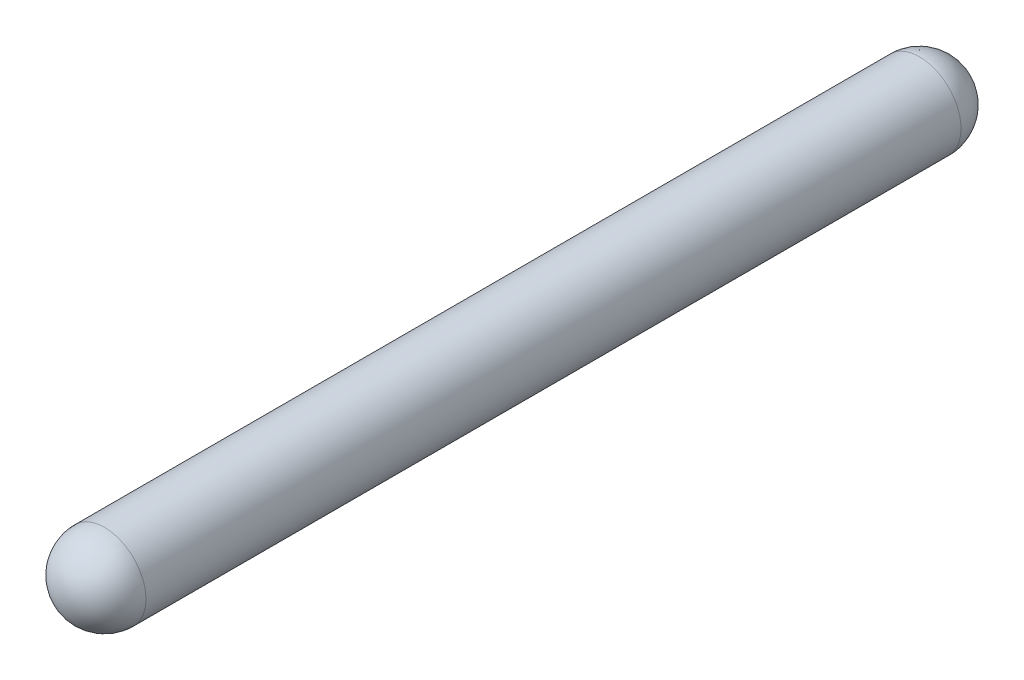
ISO-10303-21;
HEADER;
FILE_DESCRIPTION(('STEP AP214'),'2;1');
FILE_NAME('part.step','',(''),(''),'','','');
FILE_SCHEMA(('AUTOMOTIVE_DESIGN { 1 0 10303 214 1 1 1 1 }'));
ENDSEC;
DATA;
#1=APPLICATION_CONTEXT('core data for automotive mechanical design processes');
#2=APPLICATION_PROTOCOL_DEFINITION('international standard','automotive_design',2000,#1);
#3=PRODUCT_CONTEXT('',#1,'mechanical');
#4=PRODUCT('Part','Part','',(#3));
#5=PRODUCT_RELATED_PRODUCT_CATEGORY('part','',(#4));
#6=PRODUCT_DEFINITION_FORMATION('','',#4);
#7=PRODUCT_DEFINITION_CONTEXT('part definition',#1,'design');
#8=PRODUCT_DEFINITION('design','',#6,#7);
#9=PRODUCT_DEFINITION_SHAPE('','',#8);
#10=(LENGTH_UNIT() NAMED_UNIT(*) SI_UNIT(.MILLI.,.METRE.));
#11=(NAMED_UNIT(*) PLANE_ANGLE_UNIT() SI_UNIT($,.RADIAN.));
#12=(NAMED_UNIT(*) SI_UNIT($,.STERADIAN.) SOLID_ANGLE_UNIT());
#13=UNCERTAINTY_MEASURE_WITH_UNIT(LENGTH_MEASURE(1.E-05),#10,'distance_accuracy_value','');
#14=(GEOMETRIC_REPRESENTATION_CONTEXT(3) GLOBAL_UNCERTAINTY_ASSIGNED_CONTEXT((#13)) GLOBAL_UNIT_ASSIGNED_CONTEXT((#10,
#11,#12)) REPRESENTATION_CONTEXT('',''));
#15=CARTESIAN_POINT('',(0.,0.,0.));
#16=DIRECTION('',(0.,0.,1.));
#17=DIRECTION('',(1.,0.,0.));
#18=AXIS2_PLACEMENT_3D('',#15,#16,#17);
#19=CARTESIAN_POINT('',(0.,-5.08,-3.));
#20=DIRECTION('',(1.,0.,0.));
#21=DIRECTION('',(0.,-1.,0.));
#22=AXIS2_PLACEMENT_3D('',#19,#20,#21);
#23=SPHERICAL_SURFACE('',#22,0.331);
#24=CARTESIAN_POINT('',(0.,-5.08,-3.));
#25=DIRECTION('',(0.,0.,1.));
#26=DIRECTION('',(1.,0.,0.));
#27=AXIS2_PLACEMENT_3D('',#24,#25,#26);
#28=CIRCLE('',#27,0.331);
#29=CARTESIAN_POINT('',(0.331,-5.08,-3.));
#30=VERTEX_POINT('',#29);
#31=CARTESIAN_POINT('',(-0.331,-5.08,-3.));
#32=VERTEX_POINT('',#31);
#33=EDGE_CURVE('E42',#30,#32,#28,.T.);
#34=ORIENTED_EDGE('',*,*,#33,.F.);
#35=CARTESIAN_POINT('',(0.,-5.08,-3.));
#36=DIRECTION('',(0.,0.,1.));
#37=DIRECTION('',(1.,0.,0.));
#38=AXIS2_PLACEMENT_3D('',#35,#36,#37);
#39=CIRCLE('',#38,0.331);
#40=EDGE_CURVE('E26',#32,#30,#39,.T.);
#41=ORIENTED_EDGE('',*,*,#40,.F.);
#42=EDGE_LOOP('',(#34,#41));
#43=FACE_BOUND('',#42,.T.);
#44=ADVANCED_FACE('F17',(#43),#23,.T.);
#45=CARTESIAN_POINT('',(0.,-5.08,3.5));
#46=DIRECTION('',(1.,0.,0.));
#47=DIRECTION('',(0.,1.,0.));
#48=AXIS2_PLACEMENT_3D('',#45,#46,#47);
#49=SPHERICAL_SURFACE('',#48,0.331);
#50=CARTESIAN_POINT('',(0.,-5.08,3.5));
#51=DIRECTION('',(0.,0.,1.));
#52=DIRECTION('',(1.,0.,0.));
#53=AXIS2_PLACEMENT_3D('',#50,#51,#52);
#54=CIRCLE('',#53,0.331);
#55=CARTESIAN_POINT('',(0.331,-5.08,3.5));
#56=VERTEX_POINT('',#55);
#57=CARTESIAN_POINT('',(-0.331,-5.08,3.5));
#58=VERTEX_POINT('',#57);
#59=EDGE_CURVE('E11',#56,#58,#54,.F.);
#60=ORIENTED_EDGE('',*,*,#59,.F.);
#61=CARTESIAN_POINT('',(0.,-5.08,3.5));
#62=DIRECTION('',(0.,0.,1.));
#63=DIRECTION('',(1.,0.,0.));
#64=AXIS2_PLACEMENT_3D('',#61,#62,#63);
#65=CIRCLE('',#64,0.331);
#66=EDGE_CURVE('E34',#58,#56,#65,.F.);
#67=ORIENTED_EDGE('',*,*,#66,.F.);
#68=EDGE_LOOP('',(#60,#67));
#69=FACE_BOUND('',#68,.T.);
#70=ADVANCED_FACE('F49',(#69),#49,.T.);
#71=CARTESIAN_POINT('',(0.,-5.08,-3.));
#72=DIRECTION('',(0.,0.,1.));
#73=DIRECTION('',(1.,0.,0.));
#74=AXIS2_PLACEMENT_3D('',#71,#72,#73);
#75=CYLINDRICAL_SURFACE('',#74,0.331);
#76=ORIENTED_EDGE('',*,*,#66,.T.);
#77=ORIENTED_EDGE('',*,*,#59,.T.);
#78=EDGE_LOOP('',(#76,#77));
#79=FACE_BOUND('',#78,.T.);
#80=ORIENTED_EDGE('',*,*,#40,.T.);
#81=ORIENTED_EDGE('',*,*,#33,.T.);
#82=EDGE_LOOP('',(#80,#81));
#83=FACE_BOUND('',#82,.T.);
#84=ADVANCED_FACE('F45',(#79,#83),#75,.T.);
#85=CLOSED_SHELL('',(#44,#70,#84));
#86=MANIFOLD_SOLID_BREP('B1',#85);
#87=ADVANCED_BREP_SHAPE_REPRESENTATION('',(#18,#86),#14);
#88=SHAPE_DEFINITION_REPRESENTATION(#9,#87);
ENDSEC;
END-ISO-10303-21;
